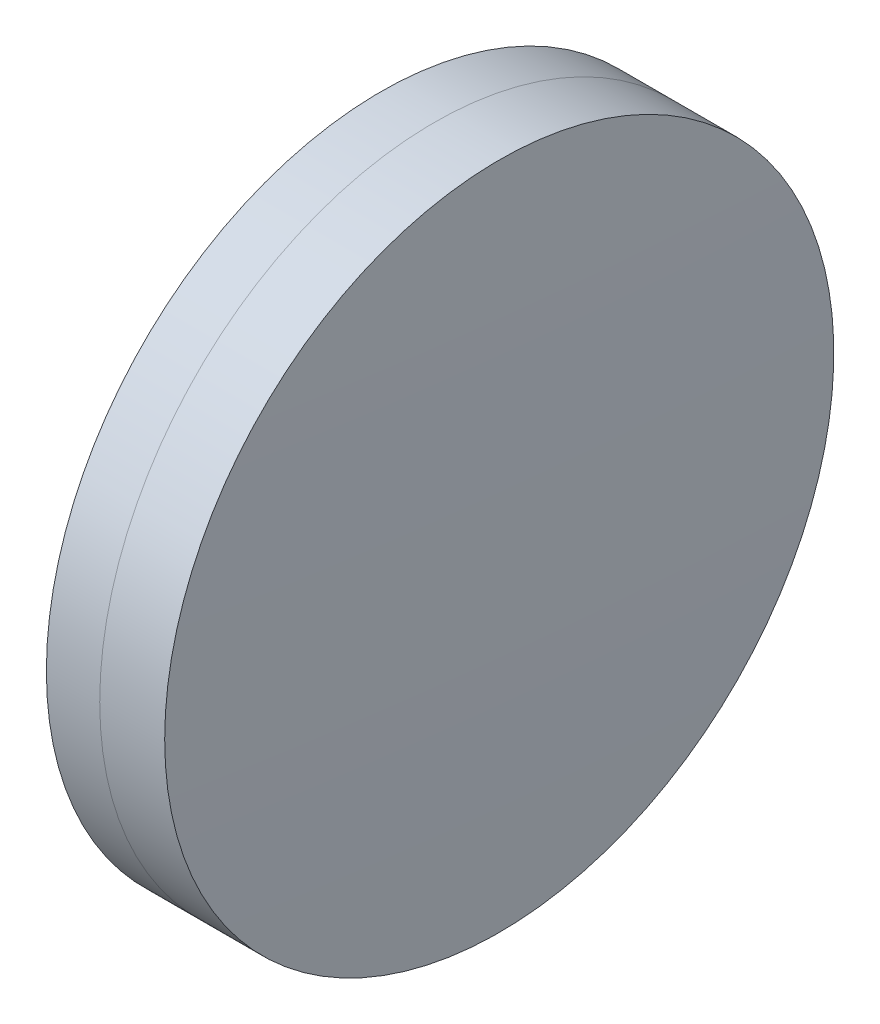
ISO-10303-21;
HEADER;
FILE_DESCRIPTION(('STEP AP214'),'2;1');
FILE_NAME('part.step','',(''),(''),'','','');
FILE_SCHEMA(('AUTOMOTIVE_DESIGN { 1 0 10303 214 1 1 1 1 }'));
ENDSEC;
DATA;
#1=APPLICATION_CONTEXT('core data for automotive mechanical design processes');
#2=APPLICATION_PROTOCOL_DEFINITION('international standard','automotive_design',2000,#1);
#3=PRODUCT_CONTEXT('',#1,'mechanical');
#4=PRODUCT('Part','Part','',(#3));
#5=PRODUCT_RELATED_PRODUCT_CATEGORY('part','',(#4));
#6=PRODUCT_DEFINITION_FORMATION('','',#4);
#7=PRODUCT_DEFINITION_CONTEXT('part definition',#1,'design');
#8=PRODUCT_DEFINITION('design','',#6,#7);
#9=PRODUCT_DEFINITION_SHAPE('','',#8);
#10=(LENGTH_UNIT() NAMED_UNIT(*) SI_UNIT(.MILLI.,.METRE.));
#11=(NAMED_UNIT(*) PLANE_ANGLE_UNIT() SI_UNIT($,.RADIAN.));
#12=(NAMED_UNIT(*) SI_UNIT($,.STERADIAN.) SOLID_ANGLE_UNIT());
#13=UNCERTAINTY_MEASURE_WITH_UNIT(LENGTH_MEASURE(1.E-05),#10,'distance_accuracy_value','');
#14=(GEOMETRIC_REPRESENTATION_CONTEXT(3) GLOBAL_UNCERTAINTY_ASSIGNED_CONTEXT((#13)) GLOBAL_UNIT_ASSIGNED_CONTEXT((#10,
#11,#12)) REPRESENTATION_CONTEXT('',''));
#15=CARTESIAN_POINT('',(0.,0.,0.));
#16=DIRECTION('',(0.,0.,1.));
#17=DIRECTION('',(1.,0.,0.));
#18=AXIS2_PLACEMENT_3D('',#15,#16,#17);
#19=CARTESIAN_POINT('',(14.8796689735747,0.,0.));
#20=DIRECTION('',(-1.,0.,0.));
#21=DIRECTION('',(0.,0.,1.));
#22=AXIS2_PLACEMENT_3D('',#19,#20,#21);
#23=SPHERICAL_SURFACE('',#22,127.78);
#24=CARTESIAN_POINT('',(142.046796801485,0.,0.));
#25=DIRECTION('',(-1.,0.,0.));
#26=DIRECTION('',(0.,0.,1.));
#27=AXIS2_PLACEMENT_3D('',#24,#25,#26);
#28=CIRCLE('',#27,12.5000000000001);
#29=CARTESIAN_POINT('',(142.046796801485,0.,12.5000000000001));
#30=VERTEX_POINT('',#29);
#31=EDGE_CURVE('E11',#30,#30,#28,.T.);
#32=ORIENTED_EDGE('',*,*,#31,.T.);
#33=EDGE_LOOP('',(#32));
#34=FACE_BOUND('',#33,.T.);
#35=ADVANCED_FACE('F45',(#34),#23,.F.);
#36=CARTESIAN_POINT('',(-0.551919992657797,0.,0.));
#37=DIRECTION('',(-1.,0.,0.));
#38=DIRECTION('',(0.,0.,1.));
#39=AXIS2_PLACEMENT_3D('',#36,#37,#38);
#40=CYLINDRICAL_SURFACE('',#39,12.5000000000001);
#41=CARTESIAN_POINT('',(144.473859289544,0.,0.));
#42=DIRECTION('',(-1.,0.,0.));
#43=DIRECTION('',(0.,0.,1.));
#44=AXIS2_PLACEMENT_3D('',#41,#42,#43);
#45=CIRCLE('',#44,12.5);
#46=CARTESIAN_POINT('',(144.473859289544,0.,12.5));
#47=VERTEX_POINT('',#46);
#48=EDGE_CURVE('E51',#47,#47,#45,.T.);
#49=ORIENTED_EDGE('',*,*,#48,.T.);
#50=EDGE_LOOP('',(#49));
#51=FACE_BOUND('',#50,.T.);
#52=ORIENTED_EDGE('',*,*,#31,.F.);
#53=EDGE_LOOP('',(#52));
#54=FACE_BOUND('',#53,.T.);
#55=ADVANCED_FACE('F57',(#51,#54),#40,.T.);
#56=CARTESIAN_POINT('',(-275.890331026425,0.,0.));
#57=DIRECTION('',(-1.,0.,0.));
#58=DIRECTION('',(0.,0.,1.));
#59=AXIS2_PLACEMENT_3D('',#56,#57,#58);
#60=SPHERICAL_SURFACE('',#59,420.55);
#61=ORIENTED_EDGE('',*,*,#48,.F.);
#62=EDGE_LOOP('',(#61));
#63=FACE_BOUND('',#62,.T.);
#64=ADVANCED_FACE('F60',(#63),#60,.T.);
#65=CLOSED_SHELL('',(#35,#55,#64));
#66=MANIFOLD_SOLID_BREP('B2',#65);
#67=CARTESIAN_POINT('',(333.319668973575,0.,0.));
#68=DIRECTION('',(-1.,0.,0.));
#69=DIRECTION('',(0.,0.,1.));
#70=AXIS2_PLACEMENT_3D('',#67,#68,#69);
#71=SPHERICAL_SURFACE('',#70,193.67);
#72=CARTESIAN_POINT('',(140.053482329351,0.,0.));
#73=DIRECTION('',(-1.,0.,0.));
#74=DIRECTION('',(0.,0.,1.));
#75=AXIS2_PLACEMENT_3D('',#72,#73,#74);
#76=CIRCLE('',#75,12.5);
#77=CARTESIAN_POINT('',(140.053482329351,0.,12.5));
#78=VERTEX_POINT('',#77);
#79=EDGE_CURVE('E44',#78,#78,#76,.T.);
#80=ORIENTED_EDGE('',*,*,#79,.T.);
#81=EDGE_LOOP('',(#80));
#82=FACE_BOUND('',#81,.T.);
#83=ADVANCED_FACE('F86',(#82),#71,.T.);
#84=CARTESIAN_POINT('',(-9.70261217833668,0.,0.));
#85=DIRECTION('',(-1.,0.,0.));
#86=DIRECTION('',(0.,0.,1.));
#87=AXIS2_PLACEMENT_3D('',#84,#85,#86);
#88=CYLINDRICAL_SURFACE('',#87,12.5);
#89=CARTESIAN_POINT('',(142.046796801485,0.,0.));
#90=DIRECTION('',(-1.,0.,0.));
#91=DIRECTION('',(0.,0.,1.));
#92=AXIS2_PLACEMENT_3D('',#89,#90,#91);
#93=CIRCLE('',#92,12.5);
#94=CARTESIAN_POINT('',(142.046796801485,0.,12.5));
#95=VERTEX_POINT('',#94);
#96=EDGE_CURVE('E92',#95,#95,#93,.T.);
#97=ORIENTED_EDGE('',*,*,#96,.T.);
#98=EDGE_LOOP('',(#97));
#99=FACE_BOUND('',#98,.T.);
#100=ORIENTED_EDGE('',*,*,#79,.F.);
#101=EDGE_LOOP('',(#100));
#102=FACE_BOUND('',#101,.T.);
#103=ADVANCED_FACE('F98',(#99,#102),#88,.T.);
#104=CARTESIAN_POINT('',(14.8796689735747,0.,0.));
#105=DIRECTION('',(-1.,0.,0.));
#106=DIRECTION('',(0.,0.,1.));
#107=AXIS2_PLACEMENT_3D('',#104,#105,#106);
#108=SPHERICAL_SURFACE('',#107,127.78);
#109=ORIENTED_EDGE('',*,*,#96,.F.);
#110=EDGE_LOOP('',(#109));
#111=FACE_BOUND('',#110,.T.);
#112=ADVANCED_FACE('F101',(#111),#108,.T.);
#113=CLOSED_SHELL('',(#83,#103,#112));
#114=MANIFOLD_SOLID_BREP('B6',#113);
#115=ADVANCED_BREP_SHAPE_REPRESENTATION('',(#18,#66,#114),#14);
#116=SHAPE_DEFINITION_REPRESENTATION(#9,#115);
ENDSEC;
END-ISO-10303-21;
